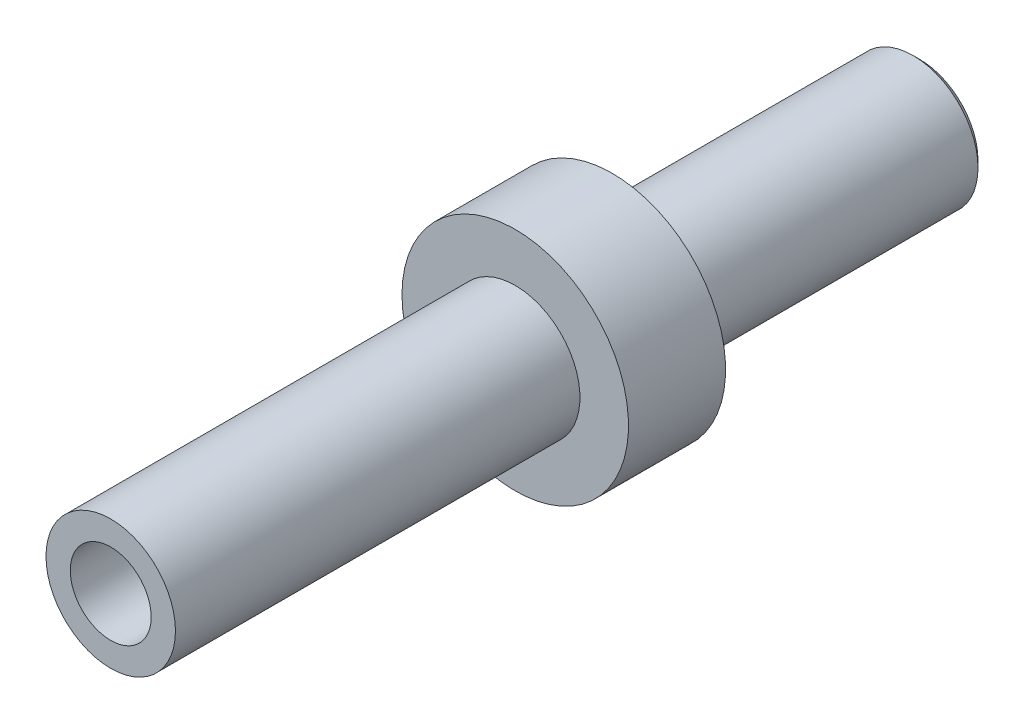
ISO-10303-21;
HEADER;
FILE_DESCRIPTION(('STEP AP214'),'2;1');
FILE_NAME('part.step','',(''),(''),'','','');
FILE_SCHEMA(('AUTOMOTIVE_DESIGN { 1 0 10303 214 1 1 1 1 }'));
ENDSEC;
DATA;
#1=APPLICATION_CONTEXT('core data for automotive mechanical design processes');
#2=APPLICATION_PROTOCOL_DEFINITION('international standard','automotive_design',2000,#1);
#3=PRODUCT_CONTEXT('',#1,'mechanical');
#4=PRODUCT('Part','Part','',(#3));
#5=PRODUCT_RELATED_PRODUCT_CATEGORY('part','',(#4));
#6=PRODUCT_DEFINITION_FORMATION('','',#4);
#7=PRODUCT_DEFINITION_CONTEXT('part definition',#1,'design');
#8=PRODUCT_DEFINITION('design','',#6,#7);
#9=PRODUCT_DEFINITION_SHAPE('','',#8);
#10=(LENGTH_UNIT() NAMED_UNIT(*) SI_UNIT(.MILLI.,.METRE.));
#11=(NAMED_UNIT(*) PLANE_ANGLE_UNIT() SI_UNIT($,.RADIAN.));
#12=(NAMED_UNIT(*) SI_UNIT($,.STERADIAN.) SOLID_ANGLE_UNIT());
#13=UNCERTAINTY_MEASURE_WITH_UNIT(LENGTH_MEASURE(1.E-05),#10,'distance_accuracy_value','');
#14=(GEOMETRIC_REPRESENTATION_CONTEXT(3) GLOBAL_UNCERTAINTY_ASSIGNED_CONTEXT((#13)) GLOBAL_UNIT_ASSIGNED_CONTEXT((#10,
#11,#12)) REPRESENTATION_CONTEXT('',''));
#15=CARTESIAN_POINT('',(0.,0.,0.));
#16=DIRECTION('',(0.,0.,1.));
#17=DIRECTION('',(1.,0.,0.));
#18=AXIS2_PLACEMENT_3D('',#15,#16,#17);
#19=CARTESIAN_POINT('',(0.,0.,25.));
#20=DIRECTION('',(0.,0.,-1.));
#21=DIRECTION('',(-1.,0.,0.));
#22=AXIS2_PLACEMENT_3D('',#19,#20,#21);
#23=CYLINDRICAL_SURFACE('',#22,2.);
#24=CARTESIAN_POINT('',(0.,0.,25.));
#25=DIRECTION('',(0.,0.,1.));
#26=DIRECTION('',(1.,0.,0.));
#27=AXIS2_PLACEMENT_3D('',#24,#25,#26);
#28=CIRCLE('',#27,2.);
#29=CARTESIAN_POINT('',(2.,0.,25.));
#30=VERTEX_POINT('',#29);
#31=EDGE_CURVE('E50',#30,#30,#28,.T.);
#32=ORIENTED_EDGE('',*,*,#31,.F.);
#33=EDGE_LOOP('',(#32));
#34=FACE_BOUND('',#33,.T.);
#35=CARTESIAN_POINT('',(0.,0.,12.5));
#36=DIRECTION('',(0.,0.,-1.));
#37=DIRECTION('',(-1.,0.,0.));
#38=AXIS2_PLACEMENT_3D('',#35,#36,#37);
#39=CIRCLE('',#38,2.);
#40=CARTESIAN_POINT('',(-2.,0.,12.5));
#41=VERTEX_POINT('',#40);
#42=EDGE_CURVE('E46',#41,#41,#39,.T.);
#43=ORIENTED_EDGE('',*,*,#42,.F.);
#44=EDGE_LOOP('',(#43));
#45=FACE_BOUND('',#44,.T.);
#46=ADVANCED_FACE('F35',(#34,#45),#23,.T.);
#47=CARTESIAN_POINT('',(0.,0.,0.200000000000006));
#48=DIRECTION('',(0.,0.,1.));
#49=DIRECTION('',(1.,0.,0.));
#50=AXIS2_PLACEMENT_3D('',#47,#48,#49);
#51=CIRCLE('',#50,2.);
#52=CARTESIAN_POINT('',(2.,0.,0.200000000000006));
#53=VERTEX_POINT('',#52);
#54=EDGE_CURVE('E42',#53,#53,#51,.T.);
#55=ORIENTED_EDGE('',*,*,#54,.T.);
#56=EDGE_LOOP('',(#55));
#57=FACE_BOUND('',#56,.T.);
#58=CARTESIAN_POINT('',(0.,0.,9.5));
#59=DIRECTION('',(0.,0.,-1.));
#60=DIRECTION('',(-1.,0.,0.));
#61=AXIS2_PLACEMENT_3D('',#58,#59,#60);
#62=CIRCLE('',#61,2.);
#63=CARTESIAN_POINT('',(-2.,0.,9.5));
#64=VERTEX_POINT('',#63);
#65=EDGE_CURVE('E65',#64,#64,#62,.T.);
#66=ORIENTED_EDGE('',*,*,#65,.T.);
#67=EDGE_LOOP('',(#66));
#68=FACE_BOUND('',#67,.T.);
#69=ADVANCED_FACE('F71',(#57,#68),#23,.T.);
#70=CARTESIAN_POINT('',(0.,0.,25.));
#71=DIRECTION('',(0.,0.,1.));
#72=DIRECTION('',(1.,0.,0.));
#73=AXIS2_PLACEMENT_3D('',#70,#71,#72);
#74=PLANE('',#73);
#75=CARTESIAN_POINT('',(0.,0.,25.));
#76=DIRECTION('',(0.,0.,1.));
#77=DIRECTION('',(1.,0.,0.));
#78=AXIS2_PLACEMENT_3D('',#75,#76,#77);
#79=CIRCLE('',#78,1.25);
#80=CARTESIAN_POINT('',(1.25,0.,25.));
#81=VERTEX_POINT('',#80);
#82=EDGE_CURVE('E56',#81,#81,#79,.T.);
#83=ORIENTED_EDGE('',*,*,#82,.F.);
#84=EDGE_LOOP('',(#83));
#85=FACE_BOUND('',#84,.T.);
#86=ORIENTED_EDGE('',*,*,#31,.T.);
#87=EDGE_LOOP('',(#86));
#88=FACE_BOUND('',#87,.T.);
#89=ADVANCED_FACE('F99',(#85,#88),#74,.T.);
#90=CARTESIAN_POINT('',(0.,0.,0.));
#91=DIRECTION('',(0.,0.,1.));
#92=DIRECTION('',(1.,0.,0.));
#93=AXIS2_PLACEMENT_3D('',#90,#91,#92);
#94=PLANE('',#93);
#95=CARTESIAN_POINT('',(0.,0.,0.));
#96=DIRECTION('',(0.,0.,1.));
#97=DIRECTION('',(1.,0.,0.));
#98=AXIS2_PLACEMENT_3D('',#95,#96,#97);
#99=CIRCLE('',#98,1.8);
#100=CARTESIAN_POINT('',(1.8,0.,0.));
#101=VERTEX_POINT('',#100);
#102=EDGE_CURVE('E10',#101,#101,#99,.F.);
#103=ORIENTED_EDGE('',*,*,#102,.T.);
#104=EDGE_LOOP('',(#103));
#105=FACE_BOUND('',#104,.T.);
#106=CARTESIAN_POINT('',(0.,0.,0.));
#107=DIRECTION('',(0.,0.,1.));
#108=DIRECTION('',(1.,0.,0.));
#109=AXIS2_PLACEMENT_3D('',#106,#107,#108);
#110=CIRCLE('',#109,1.25);
#111=CARTESIAN_POINT('',(1.25,0.,0.));
#112=VERTEX_POINT('',#111);
#113=EDGE_CURVE('E55',#112,#112,#110,.T.);
#114=ORIENTED_EDGE('',*,*,#113,.T.);
#115=EDGE_LOOP('',(#114));
#116=FACE_BOUND('',#115,.T.);
#117=ADVANCED_FACE('F91',(#105,#116),#94,.F.);
#118=CARTESIAN_POINT('',(0.,0.,0.));
#119=DIRECTION('',(0.,0.,1.));
#120=DIRECTION('',(1.,0.,0.));
#121=AXIS2_PLACEMENT_3D('',#118,#119,#120);
#122=CYLINDRICAL_SURFACE('',#121,1.25);
#123=ORIENTED_EDGE('',*,*,#113,.F.);
#124=EDGE_LOOP('',(#123));
#125=FACE_BOUND('',#124,.T.);
#126=ORIENTED_EDGE('',*,*,#82,.T.);
#127=EDGE_LOOP('',(#126));
#128=FACE_BOUND('',#127,.T.);
#129=ADVANCED_FACE('F82',(#125,#128),#122,.F.);
#130=CARTESIAN_POINT('',(0.,0.,12.5));
#131=DIRECTION('',(0.,0.,-1.));
#132=DIRECTION('',(-1.,0.,0.));
#133=AXIS2_PLACEMENT_3D('',#130,#131,#132);
#134=CYLINDRICAL_SURFACE('',#133,3.5);
#135=CARTESIAN_POINT('',(0.,0.,12.5));
#136=DIRECTION('',(0.,0.,-1.));
#137=DIRECTION('',(-1.,0.,0.));
#138=AXIS2_PLACEMENT_3D('',#135,#136,#137);
#139=CIRCLE('',#138,3.5);
#140=CARTESIAN_POINT('',(-3.5,0.,12.5));
#141=VERTEX_POINT('',#140);
#142=EDGE_CURVE('E59',#141,#141,#139,.T.);
#143=ORIENTED_EDGE('',*,*,#142,.T.);
#144=EDGE_LOOP('',(#143));
#145=FACE_BOUND('',#144,.T.);
#146=CARTESIAN_POINT('',(0.,0.,9.5));
#147=DIRECTION('',(0.,0.,-1.));
#148=DIRECTION('',(-1.,0.,0.));
#149=AXIS2_PLACEMENT_3D('',#146,#147,#148);
#150=CIRCLE('',#149,3.5);
#151=CARTESIAN_POINT('',(-3.5,0.,9.5));
#152=VERTEX_POINT('',#151);
#153=EDGE_CURVE('E62',#152,#152,#150,.T.);
#154=ORIENTED_EDGE('',*,*,#153,.F.);
#155=EDGE_LOOP('',(#154));
#156=FACE_BOUND('',#155,.T.);
#157=ADVANCED_FACE('F80',(#145,#156),#134,.T.);
#158=CARTESIAN_POINT('',(0.,0.,12.5));
#159=DIRECTION('',(0.,0.,-1.));
#160=DIRECTION('',(-1.,0.,0.));
#161=AXIS2_PLACEMENT_3D('',#158,#159,#160);
#162=PLANE('',#161);
#163=ORIENTED_EDGE('',*,*,#42,.T.);
#164=EDGE_LOOP('',(#163));
#165=FACE_BOUND('',#164,.T.);
#166=ORIENTED_EDGE('',*,*,#142,.F.);
#167=EDGE_LOOP('',(#166));
#168=FACE_BOUND('',#167,.T.);
#169=ADVANCED_FACE('F76',(#165,#168),#162,.F.);
#170=CARTESIAN_POINT('',(0.,0.,9.5));
#171=DIRECTION('',(0.,0.,-1.));
#172=DIRECTION('',(-1.,0.,0.));
#173=AXIS2_PLACEMENT_3D('',#170,#171,#172);
#174=PLANE('',#173);
#175=ORIENTED_EDGE('',*,*,#65,.F.);
#176=EDGE_LOOP('',(#175));
#177=FACE_BOUND('',#176,.T.);
#178=ORIENTED_EDGE('',*,*,#153,.T.);
#179=EDGE_LOOP('',(#178));
#180=FACE_BOUND('',#179,.T.);
#181=ADVANCED_FACE('F73',(#177,#180),#174,.T.);
#182=CARTESIAN_POINT('',(0.,0.,0.200000000000006));
#183=DIRECTION('',(0.,0.,1.));
#184=DIRECTION('',(1.,0.,0.));
#185=AXIS2_PLACEMENT_3D('',#182,#183,#184);
#186=CONICAL_SURFACE('',#185,2.,0.785398163397444);
#187=ORIENTED_EDGE('',*,*,#102,.F.);
#188=EDGE_LOOP('',(#187));
#189=FACE_BOUND('',#188,.T.);
#190=ORIENTED_EDGE('',*,*,#54,.F.);
#191=EDGE_LOOP('',(#190));
#192=FACE_BOUND('',#191,.T.);
#193=ADVANCED_FACE('F37',(#189,#192),#186,.T.);
#194=CLOSED_SHELL('',(#46,#69,#89,#117,#129,#157,#169,#181,#193));
#195=MANIFOLD_SOLID_BREP('B2',#194);
#196=ADVANCED_BREP_SHAPE_REPRESENTATION('',(#18,#195),#14);
#197=SHAPE_DEFINITION_REPRESENTATION(#9,#196);
ENDSEC;
END-ISO-10303-21;
